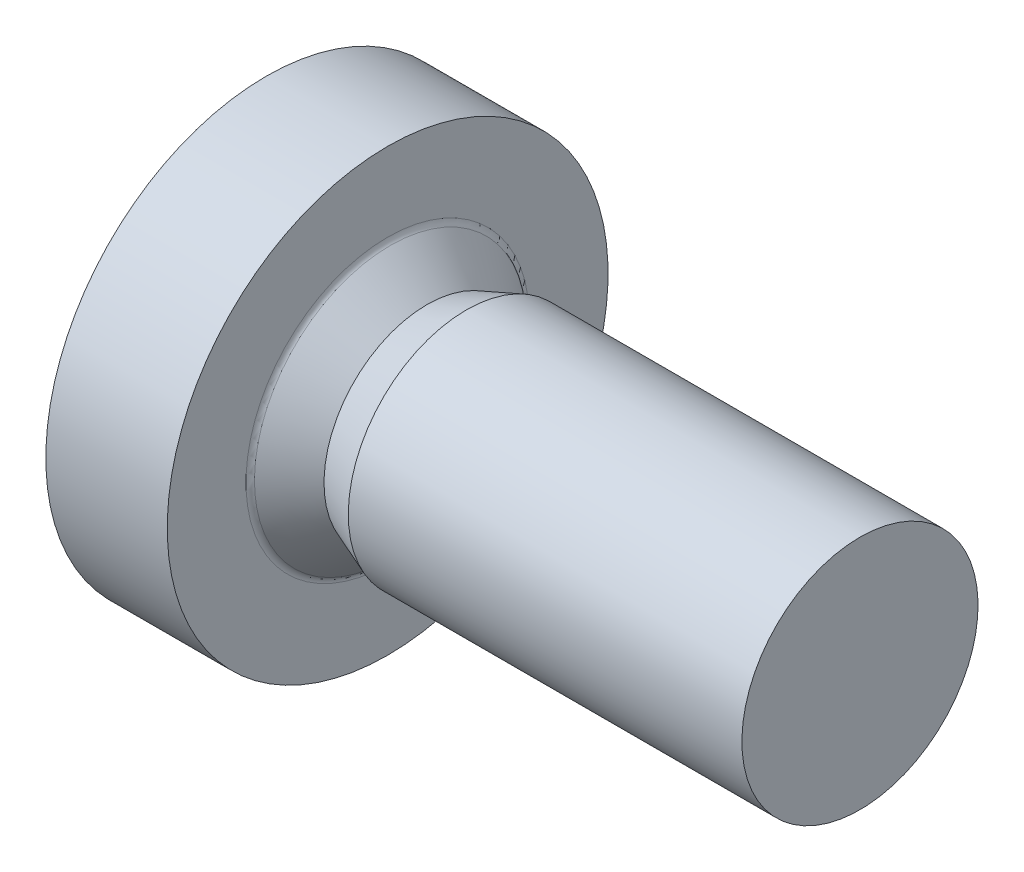
ISO-10303-21;
HEADER;
FILE_DESCRIPTION(('STEP AP214'),'2;1');
FILE_NAME('part.step','',(''),(''),'','','');
FILE_SCHEMA(('AUTOMOTIVE_DESIGN { 1 0 10303 214 1 1 1 1 }'));
ENDSEC;
DATA;
#1=APPLICATION_CONTEXT('core data for automotive mechanical design processes');
#2=APPLICATION_PROTOCOL_DEFINITION('international standard','automotive_design',2000,#1);
#3=PRODUCT_CONTEXT('',#1,'mechanical');
#4=PRODUCT('Part','Part','',(#3));
#5=PRODUCT_RELATED_PRODUCT_CATEGORY('part','',(#4));
#6=PRODUCT_DEFINITION_FORMATION('','',#4);
#7=PRODUCT_DEFINITION_CONTEXT('part definition',#1,'design');
#8=PRODUCT_DEFINITION('design','',#6,#7);
#9=PRODUCT_DEFINITION_SHAPE('','',#8);
#10=(LENGTH_UNIT() NAMED_UNIT(*) SI_UNIT(.MILLI.,.METRE.));
#11=(NAMED_UNIT(*) PLANE_ANGLE_UNIT() SI_UNIT($,.RADIAN.));
#12=(NAMED_UNIT(*) SI_UNIT($,.STERADIAN.) SOLID_ANGLE_UNIT());
#13=UNCERTAINTY_MEASURE_WITH_UNIT(LENGTH_MEASURE(1.E-05),#10,'distance_accuracy_value','');
#14=(GEOMETRIC_REPRESENTATION_CONTEXT(3) GLOBAL_UNCERTAINTY_ASSIGNED_CONTEXT((#13)) GLOBAL_UNIT_ASSIGNED_CONTEXT((#10,
#11,#12)) REPRESENTATION_CONTEXT('',''));
#15=CARTESIAN_POINT('',(0.,0.,0.));
#16=DIRECTION('',(0.,0.,1.));
#17=DIRECTION('',(1.,0.,0.));
#18=AXIS2_PLACEMENT_3D('',#15,#16,#17);
#19=CARTESIAN_POINT('',(6.,0.75,0.));
#20=DIRECTION('',(1.,0.,0.));
#21=DIRECTION('',(0.,1.,0.));
#22=AXIS2_PLACEMENT_3D('',#19,#20,#21);
#23=PLANE('',#22);
#24=CARTESIAN_POINT('',(6.,0.,0.));
#25=DIRECTION('',(1.,0.,0.));
#26=DIRECTION('',(0.,1.,0.));
#27=AXIS2_PLACEMENT_3D('',#24,#25,#26);
#28=CIRCLE('',#27,1.5);
#29=CARTESIAN_POINT('',(6.,1.5,0.));
#30=VERTEX_POINT('',#29);
#31=EDGE_CURVE('E10',#30,#30,#28,.T.);
#32=ORIENTED_EDGE('',*,*,#31,.T.);
#33=EDGE_LOOP('',(#32));
#34=FACE_BOUND('',#33,.T.);
#35=ADVANCED_FACE('F18',(#34),#23,.T.);
#36=CARTESIAN_POINT('',(3.5,0.,0.));
#37=DIRECTION('',(-1.,0.,0.));
#38=DIRECTION('',(0.,1.,0.));
#39=AXIS2_PLACEMENT_3D('',#36,#37,#38);
#40=CYLINDRICAL_SURFACE('',#39,1.5);
#41=CARTESIAN_POINT('',(1.,0.,0.));
#42=DIRECTION('',(1.,0.,0.));
#43=DIRECTION('',(0.,1.,0.));
#44=AXIS2_PLACEMENT_3D('',#41,#42,#43);
#45=CIRCLE('',#44,1.5);
#46=CARTESIAN_POINT('',(1.,1.5,0.));
#47=VERTEX_POINT('',#46);
#48=EDGE_CURVE('E27',#47,#47,#45,.T.);
#49=ORIENTED_EDGE('',*,*,#48,.T.);
#50=EDGE_LOOP('',(#49));
#51=FACE_BOUND('',#50,.T.);
#52=ORIENTED_EDGE('',*,*,#31,.F.);
#53=EDGE_LOOP('',(#52));
#54=FACE_BOUND('',#53,.T.);
#55=ADVANCED_FACE('F412',(#51,#54),#40,.T.);
#56=CARTESIAN_POINT('',(0.75,0.,0.));
#57=DIRECTION('',(1.,0.,0.));
#58=DIRECTION('',(0.,1.,0.));
#59=AXIS2_PLACEMENT_3D('',#56,#57,#58);
#60=CONICAL_SURFACE('',#59,1.404375,0.365329745380516);
#61=CARTESIAN_POINT('',(0.5,0.,0.));
#62=DIRECTION('',(1.,0.,0.));
#63=DIRECTION('',(0.,1.,0.));
#64=AXIS2_PLACEMENT_3D('',#61,#62,#63);
#65=CIRCLE('',#64,1.30875);
#66=CARTESIAN_POINT('',(0.5,1.30875,0.));
#67=VERTEX_POINT('',#66);
#68=EDGE_CURVE('E290',#67,#67,#65,.T.);
#69=ORIENTED_EDGE('',*,*,#68,.T.);
#70=EDGE_LOOP('',(#69));
#71=FACE_BOUND('',#70,.T.);
#72=ORIENTED_EDGE('',*,*,#48,.F.);
#73=EDGE_LOOP('',(#72));
#74=FACE_BOUND('',#73,.T.);
#75=ADVANCED_FACE('F417',(#71,#74),#60,.T.);
#76=CARTESIAN_POINT('',(0.266697090928547,0.,0.));
#77=DIRECTION('',(-1.,0.,0.));
#78=DIRECTION('',(0.,1.,0.));
#79=AXIS2_PLACEMENT_3D('',#76,#77,#78);
#80=CONICAL_SURFACE('',#79,1.51708001042528,0.728911585355214);
#81=CARTESIAN_POINT('',(0.0333941818570946,0.,0.));
#82=DIRECTION('',(1.,0.,0.));
#83=DIRECTION('',(0.,1.,0.));
#84=AXIS2_PLACEMENT_3D('',#81,#82,#83);
#85=CIRCLE('',#84,1.72541002085056);
#86=CARTESIAN_POINT('',(0.0333941818570951,1.72541002085056,0.));
#87=VERTEX_POINT('',#86);
#88=EDGE_CURVE('E267',#87,#87,#85,.T.);
#89=ORIENTED_EDGE('',*,*,#88,.T.);
#90=EDGE_LOOP('',(#89));
#91=FACE_BOUND('',#90,.T.);
#92=ORIENTED_EDGE('',*,*,#68,.F.);
#93=EDGE_LOOP('',(#92));
#94=FACE_BOUND('',#93,.T.);
#95=ADVANCED_FACE('F422',(#91,#94),#80,.T.);
#96=CARTESIAN_POINT('',(0.1,0.,0.));
#97=DIRECTION('',(1.,0.,0.));
#98=DIRECTION('',(0.,0.,-1.));
#99=AXIS2_PLACEMENT_3D('',#96,#97,#98);
#100=TOROIDAL_SURFACE('',#99,1.8,0.1);
#101=CARTESIAN_POINT('',(0.,0.,0.));
#102=DIRECTION('',(1.,0.,0.));
#103=DIRECTION('',(0.,1.,0.));
#104=AXIS2_PLACEMENT_3D('',#101,#102,#103);
#105=CIRCLE('',#104,1.8);
#106=CARTESIAN_POINT('',(0.,1.8,0.));
#107=VERTEX_POINT('',#106);
#108=EDGE_CURVE('E265',#107,#107,#105,.T.);
#109=ORIENTED_EDGE('',*,*,#108,.T.);
#110=EDGE_LOOP('',(#109));
#111=FACE_BOUND('',#110,.T.);
#112=ORIENTED_EDGE('',*,*,#88,.F.);
#113=EDGE_LOOP('',(#112));
#114=FACE_BOUND('',#113,.T.);
#115=ADVANCED_FACE('F428',(#111,#114),#100,.F.);
#116=CARTESIAN_POINT('',(0.,2.3,0.));
#117=DIRECTION('',(1.,0.,0.));
#118=DIRECTION('',(0.,1.,0.));
#119=AXIS2_PLACEMENT_3D('',#116,#117,#118);
#120=PLANE('',#119);
#121=CARTESIAN_POINT('',(0.,0.,0.));
#122=DIRECTION('',(1.,0.,0.));
#123=DIRECTION('',(0.,1.,0.));
#124=AXIS2_PLACEMENT_3D('',#121,#122,#123);
#125=CIRCLE('',#124,2.8);
#126=CARTESIAN_POINT('',(0.,2.8,0.));
#127=VERTEX_POINT('',#126);
#128=EDGE_CURVE('E268',#127,#127,#125,.T.);
#129=ORIENTED_EDGE('',*,*,#128,.T.);
#130=EDGE_LOOP('',(#129));
#131=FACE_BOUND('',#130,.T.);
#132=ORIENTED_EDGE('',*,*,#108,.F.);
#133=EDGE_LOOP('',(#132));
#134=FACE_BOUND('',#133,.T.);
#135=ADVANCED_FACE('F431',(#131,#134),#120,.T.);
#136=CARTESIAN_POINT('',(-0.771231517720799,0.,0.));
#137=DIRECTION('',(-1.,0.,0.));
#138=DIRECTION('',(0.,1.,0.));
#139=AXIS2_PLACEMENT_3D('',#136,#137,#138);
#140=CYLINDRICAL_SURFACE('',#139,2.8);
#141=CARTESIAN_POINT('',(-1.54246303544159,0.,0.));
#142=DIRECTION('',(1.,0.,0.));
#143=DIRECTION('',(0.,1.,0.));
#144=AXIS2_PLACEMENT_3D('',#141,#142,#143);
#145=CIRCLE('',#144,2.8);
#146=CARTESIAN_POINT('',(-1.54246303544159,2.8,0.));
#147=VERTEX_POINT('',#146);
#148=EDGE_CURVE('E174',#147,#147,#145,.T.);
#149=ORIENTED_EDGE('',*,*,#148,.T.);
#150=EDGE_LOOP('',(#149));
#151=FACE_BOUND('',#150,.T.);
#152=ORIENTED_EDGE('',*,*,#128,.F.);
#153=EDGE_LOOP('',(#152));
#154=FACE_BOUND('',#153,.T.);
#155=ADVANCED_FACE('F471',(#151,#154),#140,.T.);
#156=CARTESIAN_POINT('',(2.6,0.,0.));
#157=DIRECTION('',(0.,0.,1.));
#158=DIRECTION('',(1.,0.,0.));
#159=AXIS2_PLACEMENT_3D('',#156,#157,#158);
#160=SPHERICAL_SURFACE('',#159,5.);
#161=ORIENTED_EDGE('',*,*,#148,.F.);
#162=EDGE_LOOP('',(#161));
#163=FACE_BOUND('',#162,.T.);
#164=CARTESIAN_POINT('',(2.6,1.5,0.));
#165=DIRECTION('',(0.,1.,0.));
#166=DIRECTION('',(0.,0.,-1.));
#167=AXIS2_PLACEMENT_3D('',#164,#165,#166);
#168=CIRCLE('',#167,4.76969600708473);
#169=CARTESIAN_POINT('',(-2.16025209416476,1.5,-0.3));
#170=VERTEX_POINT('',#169);
#171=CARTESIAN_POINT('',(-2.16025209416476,1.5,0.3));
#172=VERTEX_POINT('',#171);
#173=EDGE_CURVE('E189',#170,#172,#168,.T.);
#174=ORIENTED_EDGE('',*,*,#173,.T.);
#175=CARTESIAN_POINT('',(2.6,-0.0146530414091956,0.167485029701634));
#176=DIRECTION('',(0.,-0.0871557427476582,0.996194698091746));
#177=DIRECTION('',(0.,0.996194698091746,0.0871557427476581));
#178=AXIS2_PLACEMENT_3D('',#175,#176,#177);
#179=CIRCLE('',#178,4.99717260590459);
#180=CARTESIAN_POINT('',(-2.35893576512593,0.6,0.221260202826669));
#181=VERTEX_POINT('',#180);
#182=EDGE_CURVE('E175',#172,#181,#179,.T.);
#183=ORIENTED_EDGE('',*,*,#182,.T.);
#184=CARTESIAN_POINT('',(2.6,0.245808478247197,0.425752773255334));
#185=DIRECTION('',(0.,0.5,0.866025403784438));
#186=DIRECTION('',(0.,0.866025403784438,-0.5));
#187=AXIS2_PLACEMENT_3D('',#184,#185,#186);
#188=CIRCLE('',#187,4.97577258002083);
#189=CARTESIAN_POINT('',(-2.374028589137,0.359888590016273,0.359888590016274));
#190=VERTEX_POINT('',#189);
#191=EDGE_CURVE('E261',#181,#190,#188,.T.);
#192=ORIENTED_EDGE('',*,*,#191,.T.);
#193=CARTESIAN_POINT('',(2.6,0.425752773255333,0.245808478247197));
#194=DIRECTION('',(0.,0.866025403784439,0.5));
#195=DIRECTION('',(0.,0.5,-0.866025403784439));
#196=AXIS2_PLACEMENT_3D('',#193,#194,#195);
#197=CIRCLE('',#196,4.97577258002083);
#198=CARTESIAN_POINT('',(-2.35893576512593,0.221260202826669,0.6));
#199=VERTEX_POINT('',#198);
#200=EDGE_CURVE('E206',#190,#199,#197,.T.);
#201=ORIENTED_EDGE('',*,*,#200,.T.);
#202=CARTESIAN_POINT('',(2.6,0.167485029701634,-0.0146530414091956));
#203=DIRECTION('',(0.,0.996194698091746,-0.0871557427476583));
#204=DIRECTION('',(0.,-0.0871557427476583,-0.996194698091746));
#205=AXIS2_PLACEMENT_3D('',#202,#203,#204);
#206=CIRCLE('',#205,4.99717260590459);
#207=CARTESIAN_POINT('',(-2.16025209416476,0.3,1.5));
#208=VERTEX_POINT('',#207);
#209=EDGE_CURVE('E205',#199,#208,#206,.T.);
#210=ORIENTED_EDGE('',*,*,#209,.T.);
#211=CARTESIAN_POINT('',(2.6,0.,1.5));
#212=DIRECTION('',(0.,0.,1.));
#213=DIRECTION('',(0.,1.,0.));
#214=AXIS2_PLACEMENT_3D('',#211,#212,#213);
#215=CIRCLE('',#214,4.76969600708473);
#216=CARTESIAN_POINT('',(-2.16025209416476,-0.3,1.5));
#217=VERTEX_POINT('',#216);
#218=EDGE_CURVE('E244',#208,#217,#215,.T.);
#219=ORIENTED_EDGE('',*,*,#218,.T.);
#220=CARTESIAN_POINT('',(2.6,-0.167485029701634,-0.0146530414091956));
#221=DIRECTION('',(0.,-0.996194698091746,-0.0871557427476581));
#222=DIRECTION('',(0.,-0.0871557427476581,0.996194698091746));
#223=AXIS2_PLACEMENT_3D('',#220,#221,#222);
#224=CIRCLE('',#223,4.99717260590459);
#225=CARTESIAN_POINT('',(-2.35893576512593,-0.221260202826669,0.6));
#226=VERTEX_POINT('',#225);
#227=EDGE_CURVE('E213',#217,#226,#224,.T.);
#228=ORIENTED_EDGE('',*,*,#227,.T.);
#229=CARTESIAN_POINT('',(2.6,-0.425752773255333,0.245808478247197));
#230=DIRECTION('',(0.,-0.866025403784439,0.5));
#231=DIRECTION('',(0.,0.5,0.866025403784439));
#232=AXIS2_PLACEMENT_3D('',#229,#230,#231);
#233=CIRCLE('',#232,4.97577258002083);
#234=CARTESIAN_POINT('',(-2.374028589137,-0.359888590016273,0.359888590016274));
#235=VERTEX_POINT('',#234);
#236=EDGE_CURVE('E289',#226,#235,#233,.T.);
#237=ORIENTED_EDGE('',*,*,#236,.T.);
#238=CARTESIAN_POINT('',(2.6,-0.245808478247197,0.425752773255334));
#239=DIRECTION('',(0.,-0.5,0.866025403784439));
#240=DIRECTION('',(0.,0.866025403784439,0.5));
#241=AXIS2_PLACEMENT_3D('',#238,#239,#240);
#242=CIRCLE('',#241,4.97577258002083);
#243=CARTESIAN_POINT('',(-2.35893576512593,-0.6,0.221260202826669));
#244=VERTEX_POINT('',#243);
#245=EDGE_CURVE('E243',#235,#244,#242,.T.);
#246=ORIENTED_EDGE('',*,*,#245,.T.);
#247=CARTESIAN_POINT('',(2.6,0.0146530414091956,0.167485029701634));
#248=DIRECTION('',(0.,0.0871557427476581,0.996194698091746));
#249=DIRECTION('',(0.,0.996194698091746,-0.0871557427476581));
#250=AXIS2_PLACEMENT_3D('',#247,#248,#249);
#251=CIRCLE('',#250,4.99717260590459);
#252=CARTESIAN_POINT('',(-2.16025209416476,-1.5,0.3));
#253=VERTEX_POINT('',#252);
#254=EDGE_CURVE('E183',#244,#253,#251,.T.);
#255=ORIENTED_EDGE('',*,*,#254,.T.);
#256=CARTESIAN_POINT('',(2.6,-1.5,0.));
#257=DIRECTION('',(0.,-1.,0.));
#258=DIRECTION('',(0.,0.,1.));
#259=AXIS2_PLACEMENT_3D('',#256,#257,#258);
#260=CIRCLE('',#259,4.76969600708473);
#261=CARTESIAN_POINT('',(-2.16025209416476,-1.5,-0.3));
#262=VERTEX_POINT('',#261);
#263=EDGE_CURVE('E285',#253,#262,#260,.T.);
#264=ORIENTED_EDGE('',*,*,#263,.T.);
#265=CARTESIAN_POINT('',(2.6,0.0146530414091956,-0.167485029701634));
#266=DIRECTION('',(0.,0.087155742747658,-0.996194698091746));
#267=DIRECTION('',(0.,-0.996194698091746,-0.087155742747658));
#268=AXIS2_PLACEMENT_3D('',#265,#266,#267);
#269=CIRCLE('',#268,4.99717260590459);
#270=CARTESIAN_POINT('',(-2.35893576512593,-0.6,-0.221260202826669));
#271=VERTEX_POINT('',#270);
#272=EDGE_CURVE('E229',#262,#271,#269,.T.);
#273=ORIENTED_EDGE('',*,*,#272,.T.);
#274=CARTESIAN_POINT('',(2.6,-0.245808478247196,-0.425752773255333));
#275=DIRECTION('',(0.,-0.5,-0.866025403784439));
#276=DIRECTION('',(0.,-0.866025403784439,0.5));
#277=AXIS2_PLACEMENT_3D('',#274,#275,#276);
#278=CIRCLE('',#277,4.97577258002083);
#279=CARTESIAN_POINT('',(-2.374028589137,-0.359888590016273,-0.359888590016273));
#280=VERTEX_POINT('',#279);
#281=EDGE_CURVE('E219',#271,#280,#278,.T.);
#282=ORIENTED_EDGE('',*,*,#281,.T.);
#283=CARTESIAN_POINT('',(2.6,-0.425752773255333,-0.245808478247196));
#284=DIRECTION('',(0.,-0.866025403784439,-0.5));
#285=DIRECTION('',(0.,-0.5,0.866025403784439));
#286=AXIS2_PLACEMENT_3D('',#283,#284,#285);
#287=CIRCLE('',#286,4.97577258002083);
#288=CARTESIAN_POINT('',(-2.35893576512593,-0.221260202826669,-0.6));
#289=VERTEX_POINT('',#288);
#290=EDGE_CURVE('E196',#280,#289,#287,.T.);
#291=ORIENTED_EDGE('',*,*,#290,.T.);
#292=CARTESIAN_POINT('',(2.6,-0.167485029701634,0.0146530414091956));
#293=DIRECTION('',(0.,-0.996194698091746,0.0871557427476582));
#294=DIRECTION('',(0.,0.0871557427476582,0.996194698091746));
#295=AXIS2_PLACEMENT_3D('',#292,#293,#294);
#296=CIRCLE('',#295,4.99717260590459);
#297=CARTESIAN_POINT('',(-2.16025209416476,-0.3,-1.5));
#298=VERTEX_POINT('',#297);
#299=EDGE_CURVE('E271',#289,#298,#296,.T.);
#300=ORIENTED_EDGE('',*,*,#299,.T.);
#301=CARTESIAN_POINT('',(2.6,0.,-1.5));
#302=DIRECTION('',(0.,0.,-1.));
#303=DIRECTION('',(0.,-1.,0.));
#304=AXIS2_PLACEMENT_3D('',#301,#302,#303);
#305=CIRCLE('',#304,4.76969600708473);
#306=CARTESIAN_POINT('',(-2.16025209416476,0.3,-1.5));
#307=VERTEX_POINT('',#306);
#308=EDGE_CURVE('E228',#298,#307,#305,.T.);
#309=ORIENTED_EDGE('',*,*,#308,.T.);
#310=CARTESIAN_POINT('',(2.6,0.167485029701634,0.0146530414091956));
#311=DIRECTION('',(0.,0.996194698091746,0.0871557427476582));
#312=DIRECTION('',(0.,0.0871557427476582,-0.996194698091746));
#313=AXIS2_PLACEMENT_3D('',#310,#311,#312);
#314=CIRCLE('',#313,4.99717260590459);
#315=CARTESIAN_POINT('',(-2.35893576512593,0.221260202826669,-0.6));
#316=VERTEX_POINT('',#315);
#317=EDGE_CURVE('E237',#307,#316,#314,.T.);
#318=ORIENTED_EDGE('',*,*,#317,.T.);
#319=CARTESIAN_POINT('',(2.6,0.425752773255333,-0.245808478247196));
#320=DIRECTION('',(0.,0.866025403784439,-0.5));
#321=DIRECTION('',(0.,-0.5,-0.866025403784439));
#322=AXIS2_PLACEMENT_3D('',#319,#320,#321);
#323=CIRCLE('',#322,4.97577258002083);
#324=CARTESIAN_POINT('',(-2.374028589137,0.359888590016273,-0.359888590016274));
#325=VERTEX_POINT('',#324);
#326=EDGE_CURVE('E252',#316,#325,#323,.T.);
#327=ORIENTED_EDGE('',*,*,#326,.T.);
#328=CARTESIAN_POINT('',(2.6,0.245808478247196,-0.425752773255333));
#329=DIRECTION('',(0.,0.5,-0.866025403784439));
#330=DIRECTION('',(0.,-0.866025403784439,-0.5));
#331=AXIS2_PLACEMENT_3D('',#328,#329,#330);
#332=CIRCLE('',#331,4.97577258002083);
#333=CARTESIAN_POINT('',(-2.35893576512593,0.6,-0.221260202826669));
#334=VERTEX_POINT('',#333);
#335=EDGE_CURVE('E223',#325,#334,#332,.T.);
#336=ORIENTED_EDGE('',*,*,#335,.T.);
#337=CARTESIAN_POINT('',(2.6,-0.0146530414091956,-0.167485029701633));
#338=DIRECTION('',(0.,-0.0871557427476582,-0.996194698091746));
#339=DIRECTION('',(0.,-0.996194698091746,0.0871557427476582));
#340=AXIS2_PLACEMENT_3D('',#337,#338,#339);
#341=CIRCLE('',#340,4.99717260590459);
#342=EDGE_CURVE('E297',#334,#170,#341,.T.);
#343=ORIENTED_EDGE('',*,*,#342,.T.);
#344=EDGE_LOOP('',(#174,#183,#192,#201,#210,#219,#228,#237,#246,#255,#264,#273,#282,#291,#300,
#309,#318,#327,#336,#343));
#345=FACE_BOUND('',#344,.T.);
#346=ADVANCED_FACE('F372',(#163,#345),#160,.T.);
#347=CARTESIAN_POINT('',(-1.2,0.,0.));
#348=DIRECTION('',(1.,0.,0.));
#349=DIRECTION('',(0.,0.,-1.));
#350=AXIS2_PLACEMENT_3D('',#347,#348,#349);
#351=PLANE('',#350);
#352=DIRECTION('',(0.,0.,-1.));
#353=VECTOR('',#352,1.);
#354=CARTESIAN_POINT('',(-1.2,1.5,-0.3));
#355=LINE('',#354,#353);
#356=CARTESIAN_POINT('',(-1.2,1.5,0.3));
#357=VERTEX_POINT('',#356);
#358=CARTESIAN_POINT('',(-1.2,1.5,-0.3));
#359=VERTEX_POINT('',#358);
#360=EDGE_CURVE('E167',#357,#359,#355,.T.);
#361=ORIENTED_EDGE('',*,*,#360,.T.);
#362=DIRECTION('',(0.,-0.996194698091746,0.0871557427476582));
#363=VECTOR('',#362,1.);
#364=CARTESIAN_POINT('',(-1.2,1.5,-0.3));
#365=LINE('',#364,#363);
#366=CARTESIAN_POINT('',(-1.2,0.6,-0.221260202826669));
#367=VERTEX_POINT('',#366);
#368=EDGE_CURVE('E295',#359,#367,#365,.T.);
#369=ORIENTED_EDGE('',*,*,#368,.T.);
#370=DIRECTION('',(0.,-0.866025403784439,-0.5));
#371=VECTOR('',#370,1.);
#372=CARTESIAN_POINT('',(-1.2,0.6,-0.221260202826669));
#373=LINE('',#372,#371);
#374=CARTESIAN_POINT('',(-1.2,0.359888590016273,-0.359888590016273));
#375=VERTEX_POINT('',#374);
#376=EDGE_CURVE('E318',#367,#375,#373,.T.);
#377=ORIENTED_EDGE('',*,*,#376,.T.);
#378=DIRECTION('',(0.,-0.5,-0.866025403784439));
#379=VECTOR('',#378,1.);
#380=CARTESIAN_POINT('',(-1.2,0.221260202826669,-0.6));
#381=LINE('',#380,#379);
#382=CARTESIAN_POINT('',(-1.2,0.221260202826669,-0.6));
#383=VERTEX_POINT('',#382);
#384=EDGE_CURVE('E224',#375,#383,#381,.T.);
#385=ORIENTED_EDGE('',*,*,#384,.T.);
#386=DIRECTION('',(0.,0.0871557427476582,-0.996194698091746));
#387=VECTOR('',#386,1.);
#388=CARTESIAN_POINT('',(-1.2,0.3,-1.5));
#389=LINE('',#388,#387);
#390=CARTESIAN_POINT('',(-1.2,0.3,-1.5));
#391=VERTEX_POINT('',#390);
#392=EDGE_CURVE('E253',#383,#391,#389,.T.);
#393=ORIENTED_EDGE('',*,*,#392,.T.);
#394=DIRECTION('',(0.,-1.,0.));
#395=VECTOR('',#394,1.);
#396=CARTESIAN_POINT('',(-1.2,-0.3,-1.5));
#397=LINE('',#396,#395);
#398=CARTESIAN_POINT('',(-1.2,-0.3,-1.5));
#399=VERTEX_POINT('',#398);
#400=EDGE_CURVE('E238',#391,#399,#397,.T.);
#401=ORIENTED_EDGE('',*,*,#400,.T.);
#402=DIRECTION('',(0.,0.0871557427476582,0.996194698091746));
#403=VECTOR('',#402,1.);
#404=CARTESIAN_POINT('',(-1.2,-0.3,-1.5));
#405=LINE('',#404,#403);
#406=CARTESIAN_POINT('',(-1.2,-0.221260202826669,-0.6));
#407=VERTEX_POINT('',#406);
#408=EDGE_CURVE('E194',#399,#407,#405,.T.);
#409=ORIENTED_EDGE('',*,*,#408,.T.);
#410=DIRECTION('',(0.,-0.5,0.866025403784439));
#411=VECTOR('',#410,1.);
#412=CARTESIAN_POINT('',(-1.2,-0.221260202826669,-0.6));
#413=LINE('',#412,#411);
#414=CARTESIAN_POINT('',(-1.2,-0.359888590016273,-0.359888590016273));
#415=VERTEX_POINT('',#414);
#416=EDGE_CURVE('E199',#407,#415,#413,.T.);
#417=ORIENTED_EDGE('',*,*,#416,.T.);
#418=DIRECTION('',(0.,-0.866025403784439,0.5));
#419=VECTOR('',#418,1.);
#420=CARTESIAN_POINT('',(-1.2,-0.6,-0.221260202826669));
#421=LINE('',#420,#419);
#422=CARTESIAN_POINT('',(-1.2,-0.6,-0.221260202826669));
#423=VERTEX_POINT('',#422);
#424=EDGE_CURVE('E217',#415,#423,#421,.T.);
#425=ORIENTED_EDGE('',*,*,#424,.T.);
#426=DIRECTION('',(0.,-0.996194698091746,-0.087155742747658));
#427=VECTOR('',#426,1.);
#428=CARTESIAN_POINT('',(-1.2,-1.5,-0.3));
#429=LINE('',#428,#427);
#430=CARTESIAN_POINT('',(-1.2,-1.5,-0.3));
#431=VERTEX_POINT('',#430);
#432=EDGE_CURVE('E232',#423,#431,#429,.T.);
#433=ORIENTED_EDGE('',*,*,#432,.T.);
#434=DIRECTION('',(0.,0.,1.));
#435=VECTOR('',#434,1.);
#436=CARTESIAN_POINT('',(-1.2,-1.5,0.3));
#437=LINE('',#436,#435);
#438=CARTESIAN_POINT('',(-1.2,-1.5,0.3));
#439=VERTEX_POINT('',#438);
#440=EDGE_CURVE('E284',#431,#439,#437,.T.);
#441=ORIENTED_EDGE('',*,*,#440,.T.);
#442=DIRECTION('',(0.,0.996194698091746,-0.0871557427476581));
#443=VECTOR('',#442,1.);
#444=CARTESIAN_POINT('',(-1.2,-1.5,0.3));
#445=LINE('',#444,#443);
#446=CARTESIAN_POINT('',(-1.2,-0.6,0.221260202826669));
#447=VERTEX_POINT('',#446);
#448=EDGE_CURVE('E259',#439,#447,#445,.T.);
#449=ORIENTED_EDGE('',*,*,#448,.T.);
#450=DIRECTION('',(0.,0.866025403784439,0.5));
#451=VECTOR('',#450,1.);
#452=CARTESIAN_POINT('',(-1.2,-0.6,0.221260202826669));
#453=LINE('',#452,#451);
#454=CARTESIAN_POINT('',(-1.2,-0.359888590016273,0.359888590016274));
#455=VERTEX_POINT('',#454);
#456=EDGE_CURVE('E242',#447,#455,#453,.T.);
#457=ORIENTED_EDGE('',*,*,#456,.T.);
#458=DIRECTION('',(0.,0.5,0.866025403784439));
#459=VECTOR('',#458,1.);
#460=CARTESIAN_POINT('',(-1.2,-0.221260202826669,0.6));
#461=LINE('',#460,#459);
#462=CARTESIAN_POINT('',(-1.2,-0.221260202826669,0.6));
#463=VERTEX_POINT('',#462);
#464=EDGE_CURVE('E215',#455,#463,#461,.T.);
#465=ORIENTED_EDGE('',*,*,#464,.T.);
#466=DIRECTION('',(0.,-0.0871557427476581,0.996194698091746));
#467=VECTOR('',#466,1.);
#468=CARTESIAN_POINT('',(-1.2,-0.3,1.5));
#469=LINE('',#468,#467);
#470=CARTESIAN_POINT('',(-1.2,-0.3,1.5));
#471=VERTEX_POINT('',#470);
#472=EDGE_CURVE('E212',#463,#471,#469,.T.);
#473=ORIENTED_EDGE('',*,*,#472,.T.);
#474=DIRECTION('',(0.,1.,0.));
#475=VECTOR('',#474,1.);
#476=CARTESIAN_POINT('',(-1.2,0.3,1.5));
#477=LINE('',#476,#475);
#478=CARTESIAN_POINT('',(-1.2,0.3,1.5));
#479=VERTEX_POINT('',#478);
#480=EDGE_CURVE('E313',#471,#479,#477,.T.);
#481=ORIENTED_EDGE('',*,*,#480,.T.);
#482=DIRECTION('',(0.,-0.0871557427476583,-0.996194698091746));
#483=VECTOR('',#482,1.);
#484=CARTESIAN_POINT('',(-1.2,0.3,1.5));
#485=LINE('',#484,#483);
#486=CARTESIAN_POINT('',(-1.2,0.221260202826669,0.6));
#487=VERTEX_POINT('',#486);
#488=EDGE_CURVE('E204',#479,#487,#485,.T.);
#489=ORIENTED_EDGE('',*,*,#488,.T.);
#490=DIRECTION('',(0.,0.5,-0.866025403784439));
#491=VECTOR('',#490,1.);
#492=CARTESIAN_POINT('',(-1.2,0.221260202826669,0.6));
#493=LINE('',#492,#491);
#494=CARTESIAN_POINT('',(-1.2,0.359888590016273,0.359888590016274));
#495=VERTEX_POINT('',#494);
#496=EDGE_CURVE('E264',#487,#495,#493,.T.);
#497=ORIENTED_EDGE('',*,*,#496,.T.);
#498=DIRECTION('',(0.,0.866025403784438,-0.5));
#499=VECTOR('',#498,1.);
#500=CARTESIAN_POINT('',(-1.2,0.6,0.221260202826669));
#501=LINE('',#500,#499);
#502=CARTESIAN_POINT('',(-1.2,0.6,0.221260202826669));
#503=VERTEX_POINT('',#502);
#504=EDGE_CURVE('E170',#495,#503,#501,.T.);
#505=ORIENTED_EDGE('',*,*,#504,.T.);
#506=DIRECTION('',(0.,0.996194698091746,0.0871557427476582));
#507=VECTOR('',#506,1.);
#508=CARTESIAN_POINT('',(-1.2,1.5,0.3));
#509=LINE('',#508,#507);
#510=EDGE_CURVE('E163',#503,#357,#509,.T.);
#511=ORIENTED_EDGE('',*,*,#510,.T.);
#512=EDGE_LOOP('',(#361,#369,#377,#385,#393,#401,#409,#417,#425,#433,#441,#449,#457,#465,#473,
#481,#489,#497,#505,#511));
#513=FACE_BOUND('',#512,.T.);
#514=ADVANCED_FACE('F165',(#513),#351,.F.);
#515=CARTESIAN_POINT('',(-2.64,1.05,0.260630101413334));
#516=DIRECTION('',(0.,-0.0871557427476581,0.996194698091746));
#517=DIRECTION('',(0.,-0.996194698091746,-0.0871557427476582));
#518=AXIS2_PLACEMENT_3D('',#515,#516,#517);
#519=PLANE('',#518);
#520=ORIENTED_EDGE('',*,*,#182,.F.);
#521=DIRECTION('',(1.,0.,0.));
#522=VECTOR('',#521,1.);
#523=CARTESIAN_POINT('',(-2.64,1.5,0.3));
#524=LINE('',#523,#522);
#525=EDGE_CURVE('E178',#172,#357,#524,.T.);
#526=ORIENTED_EDGE('',*,*,#525,.T.);
#527=ORIENTED_EDGE('',*,*,#510,.F.);
#528=DIRECTION('',(1.,0.,0.));
#529=VECTOR('',#528,1.);
#530=CARTESIAN_POINT('',(-2.64,0.6,0.221260202826669));
#531=LINE('',#530,#529);
#532=EDGE_CURVE('E263',#181,#503,#531,.T.);
#533=ORIENTED_EDGE('',*,*,#532,.F.);
#534=EDGE_LOOP('',(#520,#526,#527,#533));
#535=FACE_BOUND('',#534,.T.);
#536=ADVANCED_FACE('F179',(#535),#519,.F.);
#537=CARTESIAN_POINT('',(-2.64,0.479944295008137,0.290574396421471));
#538=DIRECTION('',(0.,0.5,0.866025403784438));
#539=DIRECTION('',(0.,-0.866025403784438,0.5));
#540=AXIS2_PLACEMENT_3D('',#537,#538,#539);
#541=PLANE('',#540);
#542=ORIENTED_EDGE('',*,*,#191,.F.);
#543=ORIENTED_EDGE('',*,*,#532,.T.);
#544=ORIENTED_EDGE('',*,*,#504,.F.);
#545=DIRECTION('',(1.,0.,0.));
#546=VECTOR('',#545,1.);
#547=CARTESIAN_POINT('',(-2.64,0.359888590016273,0.359888590016273));
#548=LINE('',#547,#546);
#549=EDGE_CURVE('E208',#190,#495,#548,.T.);
#550=ORIENTED_EDGE('',*,*,#549,.F.);
#551=EDGE_LOOP('',(#542,#543,#544,#550));
#552=FACE_BOUND('',#551,.T.);
#553=ADVANCED_FACE('F359',(#552),#541,.F.);
#554=CARTESIAN_POINT('',(-2.64,0.290574396421471,0.479944295008137));
#555=DIRECTION('',(0.,0.866025403784439,0.5));
#556=DIRECTION('',(0.,-0.5,0.866025403784439));
#557=AXIS2_PLACEMENT_3D('',#554,#555,#556);
#558=PLANE('',#557);
#559=ORIENTED_EDGE('',*,*,#200,.F.);
#560=ORIENTED_EDGE('',*,*,#549,.T.);
#561=ORIENTED_EDGE('',*,*,#496,.F.);
#562=DIRECTION('',(1.,0.,0.));
#563=VECTOR('',#562,1.);
#564=CARTESIAN_POINT('',(-2.64,0.221260202826669,0.6));
#565=LINE('',#564,#563);
#566=EDGE_CURVE('E201',#199,#487,#565,.T.);
#567=ORIENTED_EDGE('',*,*,#566,.F.);
#568=EDGE_LOOP('',(#559,#560,#561,#567));
#569=FACE_BOUND('',#568,.T.);
#570=ADVANCED_FACE('F355',(#569),#558,.F.);
#571=CARTESIAN_POINT('',(-2.64,0.260630101413335,1.05));
#572=DIRECTION('',(0.,0.996194698091746,-0.0871557427476583));
#573=DIRECTION('',(0.,0.0871557427476583,0.996194698091746));
#574=AXIS2_PLACEMENT_3D('',#571,#572,#573);
#575=PLANE('',#574);
#576=ORIENTED_EDGE('',*,*,#209,.F.);
#577=ORIENTED_EDGE('',*,*,#566,.T.);
#578=ORIENTED_EDGE('',*,*,#488,.F.);
#579=DIRECTION('',(1.,0.,0.));
#580=VECTOR('',#579,1.);
#581=CARTESIAN_POINT('',(-2.64,0.3,1.5));
#582=LINE('',#581,#580);
#583=EDGE_CURVE('E246',#208,#479,#582,.T.);
#584=ORIENTED_EDGE('',*,*,#583,.F.);
#585=EDGE_LOOP('',(#576,#577,#578,#584));
#586=FACE_BOUND('',#585,.T.);
#587=ADVANCED_FACE('F351',(#586),#575,.F.);
#588=CARTESIAN_POINT('',(-2.64,0.,1.5));
#589=DIRECTION('',(0.,0.,1.));
#590=DIRECTION('',(0.,-1.,0.));
#591=AXIS2_PLACEMENT_3D('',#588,#589,#590);
#592=PLANE('',#591);
#593=ORIENTED_EDGE('',*,*,#218,.F.);
#594=ORIENTED_EDGE('',*,*,#583,.T.);
#595=ORIENTED_EDGE('',*,*,#480,.F.);
#596=DIRECTION('',(1.,0.,0.));
#597=VECTOR('',#596,1.);
#598=CARTESIAN_POINT('',(-2.64,-0.3,1.5));
#599=LINE('',#598,#597);
#600=EDGE_CURVE('E209',#217,#471,#599,.T.);
#601=ORIENTED_EDGE('',*,*,#600,.F.);
#602=EDGE_LOOP('',(#593,#594,#595,#601));
#603=FACE_BOUND('',#602,.T.);
#604=ADVANCED_FACE('F348',(#603),#592,.F.);
#605=CARTESIAN_POINT('',(-2.64,-0.260630101413334,1.05));
#606=DIRECTION('',(0.,-0.996194698091746,-0.0871557427476581));
#607=DIRECTION('',(0.,0.0871557427476581,-0.996194698091746));
#608=AXIS2_PLACEMENT_3D('',#605,#606,#607);
#609=PLANE('',#608);
#610=ORIENTED_EDGE('',*,*,#227,.F.);
#611=ORIENTED_EDGE('',*,*,#600,.T.);
#612=ORIENTED_EDGE('',*,*,#472,.F.);
#613=DIRECTION('',(1.,0.,0.));
#614=VECTOR('',#613,1.);
#615=CARTESIAN_POINT('',(-2.64,-0.221260202826669,0.6));
#616=LINE('',#615,#614);
#617=EDGE_CURVE('E286',#226,#463,#616,.T.);
#618=ORIENTED_EDGE('',*,*,#617,.F.);
#619=EDGE_LOOP('',(#610,#611,#612,#618));
#620=FACE_BOUND('',#619,.T.);
#621=ADVANCED_FACE('F435',(#620),#609,.F.);
#622=CARTESIAN_POINT('',(-2.64,-0.290574396421471,0.479944295008137));
#623=DIRECTION('',(0.,-0.866025403784439,0.5));
#624=DIRECTION('',(0.,-0.5,-0.866025403784439));
#625=AXIS2_PLACEMENT_3D('',#622,#623,#624);
#626=PLANE('',#625);
#627=ORIENTED_EDGE('',*,*,#236,.F.);
#628=ORIENTED_EDGE('',*,*,#617,.T.);
#629=ORIENTED_EDGE('',*,*,#464,.F.);
#630=DIRECTION('',(1.,0.,0.));
#631=VECTOR('',#630,1.);
#632=CARTESIAN_POINT('',(-2.64,-0.359888590016273,0.359888590016274));
#633=LINE('',#632,#631);
#634=EDGE_CURVE('E239',#235,#455,#633,.T.);
#635=ORIENTED_EDGE('',*,*,#634,.F.);
#636=EDGE_LOOP('',(#627,#628,#629,#635));
#637=FACE_BOUND('',#636,.T.);
#638=ADVANCED_FACE('F438',(#637),#626,.F.);
#639=CARTESIAN_POINT('',(-2.64,-0.479944295008137,0.290574396421471));
#640=DIRECTION('',(0.,-0.5,0.866025403784439));
#641=DIRECTION('',(0.,-0.866025403784439,-0.5));
#642=AXIS2_PLACEMENT_3D('',#639,#640,#641);
#643=PLANE('',#642);
#644=ORIENTED_EDGE('',*,*,#245,.F.);
#645=ORIENTED_EDGE('',*,*,#634,.T.);
#646=ORIENTED_EDGE('',*,*,#456,.F.);
#647=DIRECTION('',(1.,0.,0.));
#648=VECTOR('',#647,1.);
#649=CARTESIAN_POINT('',(-2.64,-0.6,0.221260202826669));
#650=LINE('',#649,#648);
#651=EDGE_CURVE('E256',#244,#447,#650,.T.);
#652=ORIENTED_EDGE('',*,*,#651,.F.);
#653=EDGE_LOOP('',(#644,#645,#646,#652));
#654=FACE_BOUND('',#653,.T.);
#655=ADVANCED_FACE('F446',(#654),#643,.F.);
#656=CARTESIAN_POINT('',(-2.64,-1.05,0.260630101413335));
#657=DIRECTION('',(0.,0.0871557427476581,0.996194698091746));
#658=DIRECTION('',(0.,-0.996194698091746,0.0871557427476581));
#659=AXIS2_PLACEMENT_3D('',#656,#657,#658);
#660=PLANE('',#659);
#661=ORIENTED_EDGE('',*,*,#254,.F.);
#662=ORIENTED_EDGE('',*,*,#651,.T.);
#663=ORIENTED_EDGE('',*,*,#448,.F.);
#664=DIRECTION('',(1.,0.,0.));
#665=VECTOR('',#664,1.);
#666=CARTESIAN_POINT('',(-2.64,-1.5,0.3));
#667=LINE('',#666,#665);
#668=EDGE_CURVE('E281',#253,#439,#667,.T.);
#669=ORIENTED_EDGE('',*,*,#668,.F.);
#670=EDGE_LOOP('',(#661,#662,#663,#669));
#671=FACE_BOUND('',#670,.T.);
#672=ADVANCED_FACE('F449',(#671),#660,.F.);
#673=CARTESIAN_POINT('',(-2.64,1.5,0.));
#674=DIRECTION('',(0.,1.,0.));
#675=DIRECTION('',(0.,0.,1.));
#676=AXIS2_PLACEMENT_3D('',#673,#674,#675);
#677=PLANE('',#676);
#678=ORIENTED_EDGE('',*,*,#173,.F.);
#679=DIRECTION('',(1.,0.,0.));
#680=VECTOR('',#679,1.);
#681=CARTESIAN_POINT('',(-2.64,1.5,-0.3));
#682=LINE('',#681,#680);
#683=EDGE_CURVE('E187',#170,#359,#682,.T.);
#684=ORIENTED_EDGE('',*,*,#683,.T.);
#685=ORIENTED_EDGE('',*,*,#360,.F.);
#686=ORIENTED_EDGE('',*,*,#525,.F.);
#687=EDGE_LOOP('',(#678,#684,#685,#686));
#688=FACE_BOUND('',#687,.T.);
#689=ADVANCED_FACE('F185',(#688),#677,.F.);
#690=CARTESIAN_POINT('',(-2.64,1.05,-0.260630101413335));
#691=DIRECTION('',(0.,-0.0871557427476582,-0.996194698091746));
#692=DIRECTION('',(0.,0.996194698091746,-0.0871557427476582));
#693=AXIS2_PLACEMENT_3D('',#690,#691,#692);
#694=PLANE('',#693);
#695=ORIENTED_EDGE('',*,*,#342,.F.);
#696=DIRECTION('',(1.,0.,0.));
#697=VECTOR('',#696,1.);
#698=CARTESIAN_POINT('',(-2.64,0.6,-0.221260202826669));
#699=LINE('',#698,#697);
#700=EDGE_CURVE('E320',#334,#367,#699,.T.);
#701=ORIENTED_EDGE('',*,*,#700,.T.);
#702=ORIENTED_EDGE('',*,*,#368,.F.);
#703=ORIENTED_EDGE('',*,*,#683,.F.);
#704=EDGE_LOOP('',(#695,#701,#702,#703));
#705=FACE_BOUND('',#704,.T.);
#706=ADVANCED_FACE('F408',(#705),#694,.F.);
#707=CARTESIAN_POINT('',(-2.64,0.479944295008137,-0.290574396421471));
#708=DIRECTION('',(0.,0.5,-0.866025403784439));
#709=DIRECTION('',(0.,0.866025403784439,0.5));
#710=AXIS2_PLACEMENT_3D('',#707,#708,#709);
#711=PLANE('',#710);
#712=ORIENTED_EDGE('',*,*,#335,.F.);
#713=DIRECTION('',(1.,0.,0.));
#714=VECTOR('',#713,1.);
#715=CARTESIAN_POINT('',(-2.64,0.359888590016273,-0.359888590016274));
#716=LINE('',#715,#714);
#717=EDGE_CURVE('E220',#325,#375,#716,.T.);
#718=ORIENTED_EDGE('',*,*,#717,.T.);
#719=ORIENTED_EDGE('',*,*,#376,.F.);
#720=ORIENTED_EDGE('',*,*,#700,.F.);
#721=EDGE_LOOP('',(#712,#718,#719,#720));
#722=FACE_BOUND('',#721,.T.);
#723=ADVANCED_FACE('F401',(#722),#711,.F.);
#724=CARTESIAN_POINT('',(-2.64,0.290574396421471,-0.479944295008137));
#725=DIRECTION('',(0.,0.866025403784439,-0.5));
#726=DIRECTION('',(0.,0.5,0.866025403784439));
#727=AXIS2_PLACEMENT_3D('',#724,#725,#726);
#728=PLANE('',#727);
#729=ORIENTED_EDGE('',*,*,#326,.F.);
#730=DIRECTION('',(1.,0.,0.));
#731=VECTOR('',#730,1.);
#732=CARTESIAN_POINT('',(-2.64,0.221260202826669,-0.6));
#733=LINE('',#732,#731);
#734=EDGE_CURVE('E249',#316,#383,#733,.T.);
#735=ORIENTED_EDGE('',*,*,#734,.T.);
#736=ORIENTED_EDGE('',*,*,#384,.F.);
#737=ORIENTED_EDGE('',*,*,#717,.F.);
#738=EDGE_LOOP('',(#729,#735,#736,#737));
#739=FACE_BOUND('',#738,.T.);
#740=ADVANCED_FACE('F20',(#739),#728,.F.);
#741=CARTESIAN_POINT('',(-2.64,0.260630101413335,-1.05));
#742=DIRECTION('',(0.,0.996194698091746,0.0871557427476582));
#743=DIRECTION('',(0.,-0.0871557427476582,0.996194698091746));
#744=AXIS2_PLACEMENT_3D('',#741,#742,#743);
#745=PLANE('',#744);
#746=ORIENTED_EDGE('',*,*,#317,.F.);
#747=DIRECTION('',(1.,0.,0.));
#748=VECTOR('',#747,1.);
#749=CARTESIAN_POINT('',(-2.64,0.3,-1.5));
#750=LINE('',#749,#748);
#751=EDGE_CURVE('E234',#307,#391,#750,.T.);
#752=ORIENTED_EDGE('',*,*,#751,.T.);
#753=ORIENTED_EDGE('',*,*,#392,.F.);
#754=ORIENTED_EDGE('',*,*,#734,.F.);
#755=EDGE_LOOP('',(#746,#752,#753,#754));
#756=FACE_BOUND('',#755,.T.);
#757=ADVANCED_FACE('F393',(#756),#745,.F.);
#758=CARTESIAN_POINT('',(-2.64,0.,-1.5));
#759=DIRECTION('',(0.,0.,-1.));
#760=DIRECTION('',(0.,1.,0.));
#761=AXIS2_PLACEMENT_3D('',#758,#759,#760);
#762=PLANE('',#761);
#763=ORIENTED_EDGE('',*,*,#308,.F.);
#764=DIRECTION('',(1.,0.,0.));
#765=VECTOR('',#764,1.);
#766=CARTESIAN_POINT('',(-2.64,-0.3,-1.5));
#767=LINE('',#766,#765);
#768=EDGE_CURVE('E225',#298,#399,#767,.T.);
#769=ORIENTED_EDGE('',*,*,#768,.T.);
#770=ORIENTED_EDGE('',*,*,#400,.F.);
#771=ORIENTED_EDGE('',*,*,#751,.F.);
#772=EDGE_LOOP('',(#763,#769,#770,#771));
#773=FACE_BOUND('',#772,.T.);
#774=ADVANCED_FACE('F389',(#773),#762,.F.);
#775=CARTESIAN_POINT('',(-2.64,-0.260630101413334,-1.05));
#776=DIRECTION('',(0.,-0.996194698091746,0.0871557427476582));
#777=DIRECTION('',(0.,-0.0871557427476582,-0.996194698091746));
#778=AXIS2_PLACEMENT_3D('',#775,#776,#777);
#779=PLANE('',#778);
#780=ORIENTED_EDGE('',*,*,#299,.F.);
#781=DIRECTION('',(1.,0.,0.));
#782=VECTOR('',#781,1.);
#783=CARTESIAN_POINT('',(-2.64,-0.221260202826669,-0.6));
#784=LINE('',#783,#782);
#785=EDGE_CURVE('E248',#289,#407,#784,.T.);
#786=ORIENTED_EDGE('',*,*,#785,.T.);
#787=ORIENTED_EDGE('',*,*,#408,.F.);
#788=ORIENTED_EDGE('',*,*,#768,.F.);
#789=EDGE_LOOP('',(#780,#786,#787,#788));
#790=FACE_BOUND('',#789,.T.);
#791=ADVANCED_FACE('F386',(#790),#779,.F.);
#792=CARTESIAN_POINT('',(-2.64,-0.290574396421471,-0.479944295008137));
#793=DIRECTION('',(0.,-0.866025403784439,-0.5));
#794=DIRECTION('',(0.,0.5,-0.866025403784439));
#795=AXIS2_PLACEMENT_3D('',#792,#793,#794);
#796=PLANE('',#795);
#797=ORIENTED_EDGE('',*,*,#290,.F.);
#798=DIRECTION('',(1.,0.,0.));
#799=VECTOR('',#798,1.);
#800=CARTESIAN_POINT('',(-2.64,-0.359888590016273,-0.359888590016273));
#801=LINE('',#800,#799);
#802=EDGE_CURVE('E200',#280,#415,#801,.T.);
#803=ORIENTED_EDGE('',*,*,#802,.T.);
#804=ORIENTED_EDGE('',*,*,#416,.F.);
#805=ORIENTED_EDGE('',*,*,#785,.F.);
#806=EDGE_LOOP('',(#797,#803,#804,#805));
#807=FACE_BOUND('',#806,.T.);
#808=ADVANCED_FACE('F383',(#807),#796,.F.);
#809=CARTESIAN_POINT('',(-2.64,-0.479944295008137,-0.290574396421471));
#810=DIRECTION('',(0.,-0.5,-0.866025403784439));
#811=DIRECTION('',(0.,0.866025403784439,-0.5));
#812=AXIS2_PLACEMENT_3D('',#809,#810,#811);
#813=PLANE('',#812);
#814=ORIENTED_EDGE('',*,*,#281,.F.);
#815=DIRECTION('',(1.,0.,0.));
#816=VECTOR('',#815,1.);
#817=CARTESIAN_POINT('',(-2.64,-0.6,-0.221260202826669));
#818=LINE('',#817,#816);
#819=EDGE_CURVE('E278',#271,#423,#818,.T.);
#820=ORIENTED_EDGE('',*,*,#819,.T.);
#821=ORIENTED_EDGE('',*,*,#424,.F.);
#822=ORIENTED_EDGE('',*,*,#802,.F.);
#823=EDGE_LOOP('',(#814,#820,#821,#822));
#824=FACE_BOUND('',#823,.T.);
#825=ADVANCED_FACE('F366',(#824),#813,.F.);
#826=CARTESIAN_POINT('',(-2.64,-1.05,-0.260630101413334));
#827=DIRECTION('',(0.,0.087155742747658,-0.996194698091746));
#828=DIRECTION('',(0.,0.996194698091746,0.087155742747658));
#829=AXIS2_PLACEMENT_3D('',#826,#827,#828);
#830=PLANE('',#829);
#831=ORIENTED_EDGE('',*,*,#272,.F.);
#832=DIRECTION('',(1.,0.,0.));
#833=VECTOR('',#832,1.);
#834=CARTESIAN_POINT('',(-2.64,-1.5,-0.3));
#835=LINE('',#834,#833);
#836=EDGE_CURVE('E233',#262,#431,#835,.T.);
#837=ORIENTED_EDGE('',*,*,#836,.T.);
#838=ORIENTED_EDGE('',*,*,#432,.F.);
#839=ORIENTED_EDGE('',*,*,#819,.F.);
#840=EDGE_LOOP('',(#831,#837,#838,#839));
#841=FACE_BOUND('',#840,.T.);
#842=ADVANCED_FACE('F370',(#841),#830,.F.);
#843=CARTESIAN_POINT('',(-2.64,-1.5,0.));
#844=DIRECTION('',(0.,-1.,0.));
#845=DIRECTION('',(0.,0.,-1.));
#846=AXIS2_PLACEMENT_3D('',#843,#844,#845);
#847=PLANE('',#846);
#848=ORIENTED_EDGE('',*,*,#263,.F.);
#849=ORIENTED_EDGE('',*,*,#668,.T.);
#850=ORIENTED_EDGE('',*,*,#440,.F.);
#851=ORIENTED_EDGE('',*,*,#836,.F.);
#852=EDGE_LOOP('',(#848,#849,#850,#851));
#853=FACE_BOUND('',#852,.T.);
#854=ADVANCED_FACE('F377',(#853),#847,.F.);
#855=CLOSED_SHELL('',(#35,#55,#75,#95,#115,#135,#155,#346,#514,#536,#553,#570,#587,#604,#621,
#638,#655,#672,#689,#706,#723,#740,#757,#774,#791,#808,#825,#842,#854));
#856=MANIFOLD_SOLID_BREP('B1',#855);
#857=ADVANCED_BREP_SHAPE_REPRESENTATION('',(#18,#856),#14);
#858=SHAPE_DEFINITION_REPRESENTATION(#9,#857);
ENDSEC;
END-ISO-10303-21;
